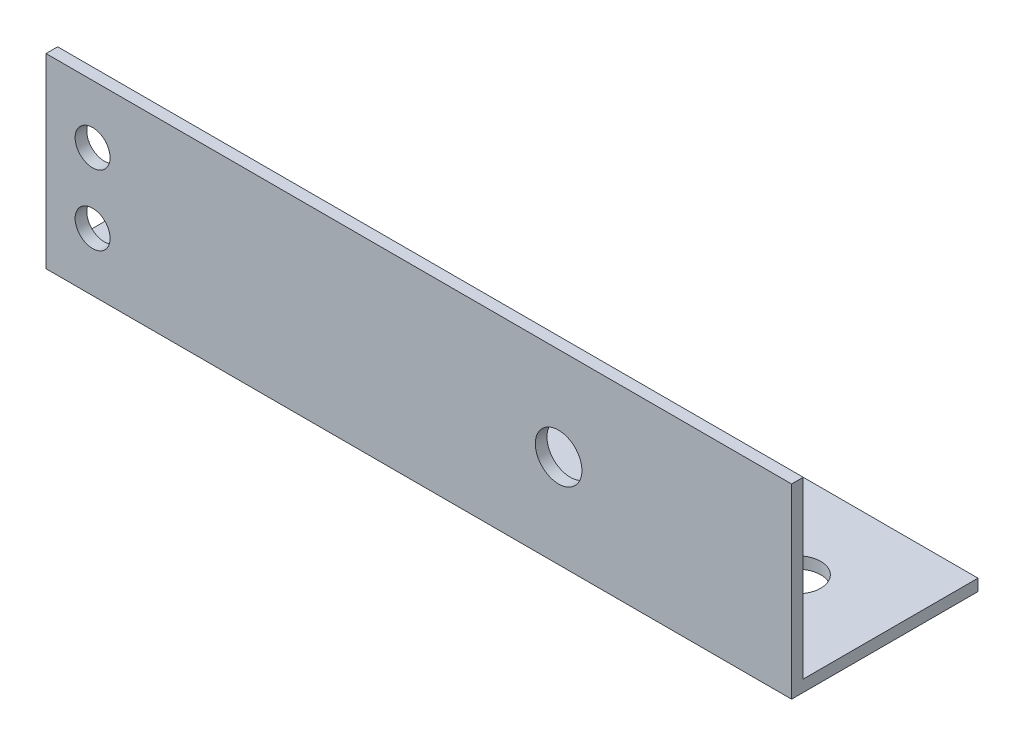
ISO-10303-21;
HEADER;
FILE_DESCRIPTION(('STEP AP214'),'2;1');
FILE_NAME('part.step','',(''),(''),'','','');
FILE_SCHEMA(('AUTOMOTIVE_DESIGN { 1 0 10303 214 1 1 1 1 }'));
ENDSEC;
DATA;
#1=APPLICATION_CONTEXT('core data for automotive mechanical design processes');
#2=APPLICATION_PROTOCOL_DEFINITION('international standard','automotive_design',2000,#1);
#3=PRODUCT_CONTEXT('',#1,'mechanical');
#4=PRODUCT('Part','Part','',(#3));
#5=PRODUCT_RELATED_PRODUCT_CATEGORY('part','',(#4));
#6=PRODUCT_DEFINITION_FORMATION('','',#4);
#7=PRODUCT_DEFINITION_CONTEXT('part definition',#1,'design');
#8=PRODUCT_DEFINITION('design','',#6,#7);
#9=PRODUCT_DEFINITION_SHAPE('','',#8);
#10=(LENGTH_UNIT() NAMED_UNIT(*) SI_UNIT(.MILLI.,.METRE.));
#11=(NAMED_UNIT(*) PLANE_ANGLE_UNIT() SI_UNIT($,.RADIAN.));
#12=(NAMED_UNIT(*) SI_UNIT($,.STERADIAN.) SOLID_ANGLE_UNIT());
#13=UNCERTAINTY_MEASURE_WITH_UNIT(LENGTH_MEASURE(1.E-05),#10,'distance_accuracy_value','');
#14=(GEOMETRIC_REPRESENTATION_CONTEXT(3) GLOBAL_UNCERTAINTY_ASSIGNED_CONTEXT((#13)) GLOBAL_UNIT_ASSIGNED_CONTEXT((#10,
#11,#12)) REPRESENTATION_CONTEXT('',''));
#15=CARTESIAN_POINT('',(0.,0.,0.));
#16=DIRECTION('',(0.,0.,1.));
#17=DIRECTION('',(1.,0.,0.));
#18=AXIS2_PLACEMENT_3D('',#15,#16,#17);
#19=CARTESIAN_POINT('',(101.6,0.,25.4));
#20=DIRECTION('',(0.,1.,0.));
#21=DIRECTION('',(0.,0.,1.));
#22=AXIS2_PLACEMENT_3D('',#19,#20,#21);
#23=PLANE('',#22);
#24=CARTESIAN_POINT('',(12.7,0.,-13.49375));
#25=DIRECTION('',(0.,1.,0.));
#26=DIRECTION('',(0.,0.,1.));
#27=AXIS2_PLACEMENT_3D('',#24,#25,#26);
#28=CIRCLE('',#27,3.175);
#29=CARTESIAN_POINT('',(12.7,0.,-10.31875));
#30=VERTEX_POINT('',#29);
#31=EDGE_CURVE('E134',#30,#30,#28,.F.);
#32=ORIENTED_EDGE('',*,*,#31,.F.);
#33=EDGE_LOOP('',(#32));
#34=FACE_BOUND('',#33,.T.);
#35=CARTESIAN_POINT('',(88.9,0.,-13.49375));
#36=DIRECTION('',(0.,1.,0.));
#37=DIRECTION('',(0.,0.,1.));
#38=AXIS2_PLACEMENT_3D('',#35,#36,#37);
#39=CIRCLE('',#38,3.175);
#40=CARTESIAN_POINT('',(88.9,0.,-10.31875));
#41=VERTEX_POINT('',#40);
#42=EDGE_CURVE('E142',#41,#41,#39,.F.);
#43=ORIENTED_EDGE('',*,*,#42,.F.);
#44=EDGE_LOOP('',(#43));
#45=FACE_BOUND('',#44,.T.);
#46=DIRECTION('',(0.,0.,-1.));
#47=VECTOR('',#46,1.);
#48=CARTESIAN_POINT('',(101.6,0.,25.4));
#49=LINE('',#48,#47);
#50=CARTESIAN_POINT('',(101.6,0.,0.));
#51=VERTEX_POINT('',#50);
#52=CARTESIAN_POINT('',(101.6,0.,-25.4));
#53=VERTEX_POINT('',#52);
#54=EDGE_CURVE('E43',#51,#53,#49,.T.);
#55=ORIENTED_EDGE('',*,*,#54,.F.);
#56=DIRECTION('',(-1.,0.,0.));
#57=VECTOR('',#56,1.);
#58=CARTESIAN_POINT('',(101.6,0.,0.));
#59=LINE('',#58,#57);
#60=CARTESIAN_POINT('',(0.,0.,0.));
#61=VERTEX_POINT('',#60);
#62=EDGE_CURVE('E95',#51,#61,#59,.T.);
#63=ORIENTED_EDGE('',*,*,#62,.T.);
#64=DIRECTION('',(0.,0.,-1.));
#65=VECTOR('',#64,1.);
#66=CARTESIAN_POINT('',(0.,0.,25.4));
#67=LINE('',#66,#65);
#68=CARTESIAN_POINT('',(0.,0.,-25.4));
#69=VERTEX_POINT('',#68);
#70=EDGE_CURVE('E109',#61,#69,#67,.T.);
#71=ORIENTED_EDGE('',*,*,#70,.T.);
#72=DIRECTION('',(-1.,0.,0.));
#73=VECTOR('',#72,1.);
#74=CARTESIAN_POINT('',(101.6,0.,-25.4));
#75=LINE('',#74,#73);
#76=EDGE_CURVE('E106',#53,#69,#75,.T.);
#77=ORIENTED_EDGE('',*,*,#76,.F.);
#78=EDGE_LOOP('',(#55,#63,#71,#77));
#79=FACE_BOUND('',#78,.T.);
#80=ADVANCED_FACE('F35',(#34,#45,#79),#23,.F.);
#81=CARTESIAN_POINT('',(101.6,25.4,0.));
#82=DIRECTION('',(0.,-1.,0.));
#83=DIRECTION('',(0.,0.,-1.));
#84=AXIS2_PLACEMENT_3D('',#81,#82,#83);
#85=PLANE('',#84);
#86=DIRECTION('',(0.,0.,1.));
#87=VECTOR('',#86,1.);
#88=CARTESIAN_POINT('',(0.,25.4,0.));
#89=LINE('',#88,#87);
#90=CARTESIAN_POINT('',(0.,25.4,-1.5875));
#91=VERTEX_POINT('',#90);
#92=CARTESIAN_POINT('',(0.,25.4,0.));
#93=VERTEX_POINT('',#92);
#94=EDGE_CURVE('E79',#91,#93,#89,.T.);
#95=ORIENTED_EDGE('',*,*,#94,.T.);
#96=DIRECTION('',(1.,0.,0.));
#97=VECTOR('',#96,1.);
#98=CARTESIAN_POINT('',(101.6,25.4,0.));
#99=LINE('',#98,#97);
#100=CARTESIAN_POINT('',(101.6,25.4,0.));
#101=VERTEX_POINT('',#100);
#102=EDGE_CURVE('E51',#93,#101,#99,.T.);
#103=ORIENTED_EDGE('',*,*,#102,.T.);
#104=DIRECTION('',(0.,0.,1.));
#105=VECTOR('',#104,1.);
#106=CARTESIAN_POINT('',(101.6,25.4,0.));
#107=LINE('',#106,#105);
#108=CARTESIAN_POINT('',(101.6,25.4,-1.5875));
#109=VERTEX_POINT('',#108);
#110=EDGE_CURVE('E11',#109,#101,#107,.T.);
#111=ORIENTED_EDGE('',*,*,#110,.F.);
#112=DIRECTION('',(-1.,0.,0.));
#113=VECTOR('',#112,1.);
#114=CARTESIAN_POINT('',(101.6,25.4,-1.5875));
#115=LINE('',#114,#113);
#116=EDGE_CURVE('E121',#109,#91,#115,.T.);
#117=ORIENTED_EDGE('',*,*,#116,.T.);
#118=EDGE_LOOP('',(#95,#103,#111,#117));
#119=FACE_BOUND('',#118,.T.);
#120=ADVANCED_FACE('F210',(#119),#85,.F.);
#121=CARTESIAN_POINT('',(101.6,0.,0.));
#122=DIRECTION('',(1.,0.,0.));
#123=DIRECTION('',(0.,0.,-1.));
#124=AXIS2_PLACEMENT_3D('',#121,#122,#123);
#125=PLANE('',#124);
#126=DIRECTION('',(0.,-1.,0.));
#127=VECTOR('',#126,1.);
#128=CARTESIAN_POINT('',(101.6,0.,0.));
#129=LINE('',#128,#127);
#130=EDGE_CURVE('E97',#101,#51,#129,.T.);
#131=ORIENTED_EDGE('',*,*,#130,.T.);
#132=ORIENTED_EDGE('',*,*,#54,.T.);
#133=DIRECTION('',(0.,-1.,0.));
#134=VECTOR('',#133,1.);
#135=CARTESIAN_POINT('',(101.6,1.5875,-25.4));
#136=LINE('',#135,#134);
#137=CARTESIAN_POINT('',(101.6,1.5875,-25.4));
#138=VERTEX_POINT('',#137);
#139=EDGE_CURVE('E128',#138,#53,#136,.T.);
#140=ORIENTED_EDGE('',*,*,#139,.F.);
#141=DIRECTION('',(0.,0.,-1.));
#142=VECTOR('',#141,1.);
#143=CARTESIAN_POINT('',(101.6,1.5875,-1.5875));
#144=LINE('',#143,#142);
#145=CARTESIAN_POINT('',(101.6,1.5875,-1.5875));
#146=VERTEX_POINT('',#145);
#147=EDGE_CURVE('E137',#146,#138,#144,.T.);
#148=ORIENTED_EDGE('',*,*,#147,.F.);
#149=DIRECTION('',(0.,-1.,0.));
#150=VECTOR('',#149,1.);
#151=CARTESIAN_POINT('',(101.6,25.4,-1.5875));
#152=LINE('',#151,#150);
#153=EDGE_CURVE('E125',#109,#146,#152,.T.);
#154=ORIENTED_EDGE('',*,*,#153,.F.);
#155=ORIENTED_EDGE('',*,*,#110,.T.);
#156=EDGE_LOOP('',(#131,#132,#140,#148,#154,#155));
#157=FACE_BOUND('',#156,.T.);
#158=ADVANCED_FACE('F102',(#157),#125,.T.);
#159=CARTESIAN_POINT('',(0.,0.,0.));
#160=DIRECTION('',(1.,0.,0.));
#161=DIRECTION('',(0.,0.,-1.));
#162=AXIS2_PLACEMENT_3D('',#159,#160,#161);
#163=PLANE('',#162);
#164=ORIENTED_EDGE('',*,*,#70,.F.);
#165=DIRECTION('',(0.,-1.,0.));
#166=VECTOR('',#165,1.);
#167=CARTESIAN_POINT('',(0.,0.,0.));
#168=LINE('',#167,#166);
#169=EDGE_CURVE('E98',#93,#61,#168,.T.);
#170=ORIENTED_EDGE('',*,*,#169,.F.);
#171=ORIENTED_EDGE('',*,*,#94,.F.);
#172=DIRECTION('',(0.,-1.,0.));
#173=VECTOR('',#172,1.);
#174=CARTESIAN_POINT('',(0.,25.4,-1.5875));
#175=LINE('',#174,#173);
#176=CARTESIAN_POINT('',(0.,1.5875,-1.5875));
#177=VERTEX_POINT('',#176);
#178=EDGE_CURVE('E126',#91,#177,#175,.T.);
#179=ORIENTED_EDGE('',*,*,#178,.T.);
#180=DIRECTION('',(0.,0.,-1.));
#181=VECTOR('',#180,1.);
#182=CARTESIAN_POINT('',(0.,1.5875,-1.5875));
#183=LINE('',#182,#181);
#184=CARTESIAN_POINT('',(0.,1.5875,-25.4));
#185=VERTEX_POINT('',#184);
#186=EDGE_CURVE('E129',#177,#185,#183,.T.);
#187=ORIENTED_EDGE('',*,*,#186,.T.);
#188=DIRECTION('',(0.,-1.,0.));
#189=VECTOR('',#188,1.);
#190=CARTESIAN_POINT('',(0.,1.5875,-25.4));
#191=LINE('',#190,#189);
#192=EDGE_CURVE('E132',#185,#69,#191,.T.);
#193=ORIENTED_EDGE('',*,*,#192,.T.);
#194=EDGE_LOOP('',(#164,#170,#171,#179,#187,#193));
#195=FACE_BOUND('',#194,.T.);
#196=ADVANCED_FACE('F186',(#195),#163,.F.);
#197=CARTESIAN_POINT('',(6.35,7.9375,-100.0125));
#198=DIRECTION('',(0.,0.,1.));
#199=DIRECTION('',(1.,0.,0.));
#200=AXIS2_PLACEMENT_3D('',#197,#198,#199);
#201=CYLINDRICAL_SURFACE('',#200,2.38125);
#202=CARTESIAN_POINT('',(6.35,7.9375,0.));
#203=DIRECTION('',(0.,0.,-1.));
#204=DIRECTION('',(-1.,0.,0.));
#205=AXIS2_PLACEMENT_3D('',#202,#203,#204);
#206=CIRCLE('',#205,2.38125);
#207=CARTESIAN_POINT('',(3.96875,7.9375,0.));
#208=VERTEX_POINT('',#207);
#209=EDGE_CURVE('E161',#208,#208,#206,.F.);
#210=ORIENTED_EDGE('',*,*,#209,.T.);
#211=EDGE_LOOP('',(#210));
#212=FACE_BOUND('',#211,.T.);
#213=CARTESIAN_POINT('',(6.35,7.9375,-1.5875));
#214=DIRECTION('',(0.,0.,1.));
#215=DIRECTION('',(1.,0.,0.));
#216=AXIS2_PLACEMENT_3D('',#213,#214,#215);
#217=CIRCLE('',#216,2.38125);
#218=CARTESIAN_POINT('',(8.73125,7.9375,-1.5875));
#219=VERTEX_POINT('',#218);
#220=EDGE_CURVE('E152',#219,#219,#217,.T.);
#221=ORIENTED_EDGE('',*,*,#220,.F.);
#222=EDGE_LOOP('',(#221));
#223=FACE_BOUND('',#222,.T.);
#224=ADVANCED_FACE('F182',(#212,#223),#201,.F.);
#225=CARTESIAN_POINT('',(6.35,17.4625,-100.0125));
#226=DIRECTION('',(0.,0.,1.));
#227=DIRECTION('',(1.,0.,0.));
#228=AXIS2_PLACEMENT_3D('',#225,#226,#227);
#229=CYLINDRICAL_SURFACE('',#228,2.38125);
#230=CARTESIAN_POINT('',(6.35,17.4625,0.));
#231=DIRECTION('',(0.,0.,-1.));
#232=DIRECTION('',(-1.,0.,0.));
#233=AXIS2_PLACEMENT_3D('',#230,#231,#232);
#234=CIRCLE('',#233,2.38125);
#235=CARTESIAN_POINT('',(3.96875,17.4625,0.));
#236=VERTEX_POINT('',#235);
#237=EDGE_CURVE('E164',#236,#236,#234,.F.);
#238=ORIENTED_EDGE('',*,*,#237,.T.);
#239=EDGE_LOOP('',(#238));
#240=FACE_BOUND('',#239,.T.);
#241=CARTESIAN_POINT('',(6.35,17.4625,-1.5875));
#242=DIRECTION('',(0.,0.,1.));
#243=DIRECTION('',(1.,0.,0.));
#244=AXIS2_PLACEMENT_3D('',#241,#242,#243);
#245=CIRCLE('',#244,2.38125);
#246=CARTESIAN_POINT('',(8.73125,17.4625,-1.5875));
#247=VERTEX_POINT('',#246);
#248=EDGE_CURVE('E155',#247,#247,#245,.T.);
#249=ORIENTED_EDGE('',*,*,#248,.F.);
#250=EDGE_LOOP('',(#249));
#251=FACE_BOUND('',#250,.T.);
#252=ADVANCED_FACE('F185',(#240,#251),#229,.F.);
#253=CARTESIAN_POINT('',(69.85,12.7,-100.0125));
#254=DIRECTION('',(0.,0.,1.));
#255=DIRECTION('',(1.,0.,0.));
#256=AXIS2_PLACEMENT_3D('',#253,#254,#255);
#257=CYLINDRICAL_SURFACE('',#256,3.175);
#258=CARTESIAN_POINT('',(69.85,12.7,0.));
#259=DIRECTION('',(0.,0.,-1.));
#260=DIRECTION('',(-1.,0.,0.));
#261=AXIS2_PLACEMENT_3D('',#258,#259,#260);
#262=CIRCLE('',#261,3.175);
#263=CARTESIAN_POINT('',(66.675,12.7,0.));
#264=VERTEX_POINT('',#263);
#265=EDGE_CURVE('E38',#264,#264,#262,.F.);
#266=ORIENTED_EDGE('',*,*,#265,.T.);
#267=EDGE_LOOP('',(#266));
#268=FACE_BOUND('',#267,.T.);
#269=CARTESIAN_POINT('',(69.85,12.7,-1.5875));
#270=DIRECTION('',(0.,0.,1.));
#271=DIRECTION('',(1.,0.,0.));
#272=AXIS2_PLACEMENT_3D('',#269,#270,#271);
#273=CIRCLE('',#272,3.175);
#274=CARTESIAN_POINT('',(73.025,12.7,-1.5875));
#275=VERTEX_POINT('',#274);
#276=EDGE_CURVE('E149',#275,#275,#273,.T.);
#277=ORIENTED_EDGE('',*,*,#276,.F.);
#278=EDGE_LOOP('',(#277));
#279=FACE_BOUND('',#278,.T.);
#280=ADVANCED_FACE('F172',(#268,#279),#257,.F.);
#281=CARTESIAN_POINT('',(101.6,1.5875,-25.4));
#282=DIRECTION('',(0.,0.,-1.));
#283=DIRECTION('',(-1.,0.,0.));
#284=AXIS2_PLACEMENT_3D('',#281,#282,#283);
#285=PLANE('',#284);
#286=ORIENTED_EDGE('',*,*,#192,.F.);
#287=DIRECTION('',(-1.,0.,0.));
#288=VECTOR('',#287,1.);
#289=CARTESIAN_POINT('',(101.6,1.5875,-25.4));
#290=LINE('',#289,#288);
#291=EDGE_CURVE('E113',#138,#185,#290,.T.);
#292=ORIENTED_EDGE('',*,*,#291,.F.);
#293=ORIENTED_EDGE('',*,*,#139,.T.);
#294=ORIENTED_EDGE('',*,*,#76,.T.);
#295=EDGE_LOOP('',(#286,#292,#293,#294));
#296=FACE_BOUND('',#295,.T.);
#297=ADVANCED_FACE('F199',(#296),#285,.T.);
#298=CARTESIAN_POINT('',(101.6,1.5875,-1.5875));
#299=DIRECTION('',(0.,1.,0.));
#300=DIRECTION('',(0.,0.,1.));
#301=AXIS2_PLACEMENT_3D('',#298,#299,#300);
#302=PLANE('',#301);
#303=CARTESIAN_POINT('',(12.7,1.5875,-13.49375));
#304=DIRECTION('',(0.,-1.,0.));
#305=DIRECTION('',(0.,0.,-1.));
#306=AXIS2_PLACEMENT_3D('',#303,#304,#305);
#307=CIRCLE('',#306,3.175);
#308=CARTESIAN_POINT('',(12.7,1.5875,-16.66875));
#309=VERTEX_POINT('',#308);
#310=EDGE_CURVE('E145',#309,#309,#307,.T.);
#311=ORIENTED_EDGE('',*,*,#310,.T.);
#312=EDGE_LOOP('',(#311));
#313=FACE_BOUND('',#312,.T.);
#314=CARTESIAN_POINT('',(88.9,1.5875,-13.49375));
#315=DIRECTION('',(0.,-1.,0.));
#316=DIRECTION('',(0.,0.,-1.));
#317=AXIS2_PLACEMENT_3D('',#314,#315,#316);
#318=CIRCLE('',#317,3.175);
#319=CARTESIAN_POINT('',(88.9,1.5875,-16.66875));
#320=VERTEX_POINT('',#319);
#321=EDGE_CURVE('E146',#320,#320,#318,.T.);
#322=ORIENTED_EDGE('',*,*,#321,.T.);
#323=EDGE_LOOP('',(#322));
#324=FACE_BOUND('',#323,.T.);
#325=ORIENTED_EDGE('',*,*,#186,.F.);
#326=DIRECTION('',(-1.,0.,0.));
#327=VECTOR('',#326,1.);
#328=CARTESIAN_POINT('',(101.6,1.5875,-1.5875));
#329=LINE('',#328,#327);
#330=EDGE_CURVE('E117',#146,#177,#329,.T.);
#331=ORIENTED_EDGE('',*,*,#330,.F.);
#332=ORIENTED_EDGE('',*,*,#147,.T.);
#333=ORIENTED_EDGE('',*,*,#291,.T.);
#334=EDGE_LOOP('',(#325,#331,#332,#333));
#335=FACE_BOUND('',#334,.T.);
#336=ADVANCED_FACE('F194',(#313,#324,#335),#302,.T.);
#337=CARTESIAN_POINT('',(101.6,25.4,-1.5875));
#338=DIRECTION('',(0.,0.,-1.));
#339=DIRECTION('',(0.,1.,0.));
#340=AXIS2_PLACEMENT_3D('',#337,#338,#339);
#341=PLANE('',#340);
#342=ORIENTED_EDGE('',*,*,#276,.T.);
#343=EDGE_LOOP('',(#342));
#344=FACE_BOUND('',#343,.T.);
#345=ORIENTED_EDGE('',*,*,#248,.T.);
#346=EDGE_LOOP('',(#345));
#347=FACE_BOUND('',#346,.T.);
#348=ORIENTED_EDGE('',*,*,#220,.T.);
#349=EDGE_LOOP('',(#348));
#350=FACE_BOUND('',#349,.T.);
#351=ORIENTED_EDGE('',*,*,#178,.F.);
#352=ORIENTED_EDGE('',*,*,#116,.F.);
#353=ORIENTED_EDGE('',*,*,#153,.T.);
#354=ORIENTED_EDGE('',*,*,#330,.T.);
#355=EDGE_LOOP('',(#351,#352,#353,#354));
#356=FACE_BOUND('',#355,.T.);
#357=ADVANCED_FACE('F190',(#344,#347,#350,#356),#341,.T.);
#358=CARTESIAN_POINT('',(88.9,-100.0125,-13.49375));
#359=DIRECTION('',(0.,1.,0.));
#360=DIRECTION('',(0.,0.,1.));
#361=AXIS2_PLACEMENT_3D('',#358,#359,#360);
#362=CYLINDRICAL_SURFACE('',#361,3.175);
#363=ORIENTED_EDGE('',*,*,#321,.F.);
#364=EDGE_LOOP('',(#363));
#365=FACE_BOUND('',#364,.T.);
#366=ORIENTED_EDGE('',*,*,#42,.T.);
#367=EDGE_LOOP('',(#366));
#368=FACE_BOUND('',#367,.T.);
#369=ADVANCED_FACE('F193',(#365,#368),#362,.F.);
#370=CARTESIAN_POINT('',(12.7,-100.0125,-13.49375));
#371=DIRECTION('',(0.,1.,0.));
#372=DIRECTION('',(0.,0.,1.));
#373=AXIS2_PLACEMENT_3D('',#370,#371,#372);
#374=CYLINDRICAL_SURFACE('',#373,3.175);
#375=ORIENTED_EDGE('',*,*,#310,.F.);
#376=EDGE_LOOP('',(#375));
#377=FACE_BOUND('',#376,.T.);
#378=ORIENTED_EDGE('',*,*,#31,.T.);
#379=EDGE_LOOP('',(#378));
#380=FACE_BOUND('',#379,.T.);
#381=ADVANCED_FACE('F177',(#377,#380),#374,.F.);
#382=CARTESIAN_POINT('',(101.6,0.,0.));
#383=DIRECTION('',(0.,0.,-1.));
#384=DIRECTION('',(-1.,0.,0.));
#385=AXIS2_PLACEMENT_3D('',#382,#383,#384);
#386=PLANE('',#385);
#387=ORIENTED_EDGE('',*,*,#237,.F.);
#388=EDGE_LOOP('',(#387));
#389=FACE_BOUND('',#388,.T.);
#390=ORIENTED_EDGE('',*,*,#265,.F.);
#391=EDGE_LOOP('',(#390));
#392=FACE_BOUND('',#391,.T.);
#393=ORIENTED_EDGE('',*,*,#209,.F.);
#394=EDGE_LOOP('',(#393));
#395=FACE_BOUND('',#394,.T.);
#396=ORIENTED_EDGE('',*,*,#169,.T.);
#397=ORIENTED_EDGE('',*,*,#62,.F.);
#398=ORIENTED_EDGE('',*,*,#130,.F.);
#399=ORIENTED_EDGE('',*,*,#102,.F.);
#400=EDGE_LOOP('',(#396,#397,#398,#399));
#401=FACE_BOUND('',#400,.T.);
#402=ADVANCED_FACE('F96',(#389,#392,#395,#401),#386,.F.);
#403=CLOSED_SHELL('',(#80,#120,#158,#196,#224,#252,#280,#297,#336,#357,#369,#381,#402));
#404=MANIFOLD_SOLID_BREP('B2',#403);
#405=ADVANCED_BREP_SHAPE_REPRESENTATION('',(#18,#404),#14);
#406=SHAPE_DEFINITION_REPRESENTATION(#9,#405);
ENDSEC;
END-ISO-10303-21;
